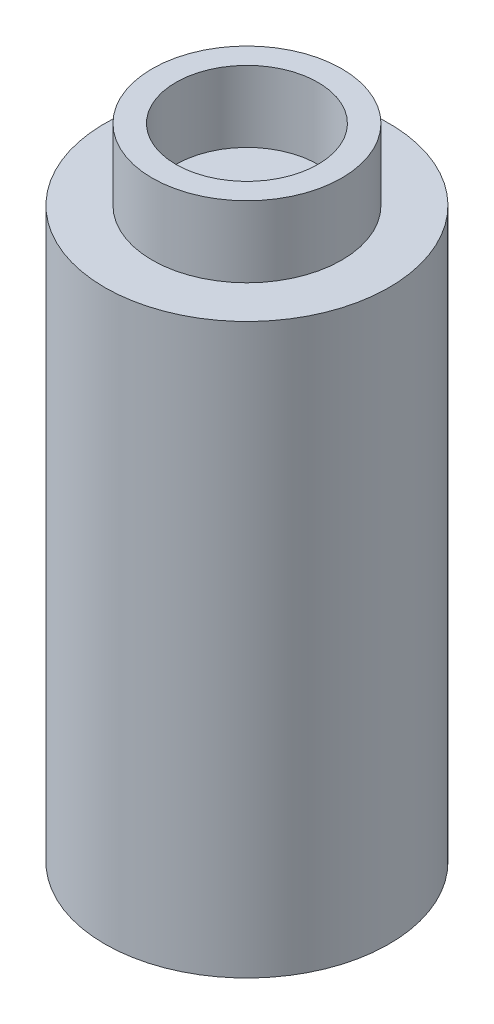
ISO-10303-21;
HEADER;
FILE_DESCRIPTION(('STEP AP214'),'2;1');
FILE_NAME('part.step','',(''),(''),'','','');
FILE_SCHEMA(('AUTOMOTIVE_DESIGN { 1 0 10303 214 1 1 1 1 }'));
ENDSEC;
DATA;
#1=APPLICATION_CONTEXT('core data for automotive mechanical design processes');
#2=APPLICATION_PROTOCOL_DEFINITION('international standard','automotive_design',2000,#1);
#3=PRODUCT_CONTEXT('',#1,'mechanical');
#4=PRODUCT('Part','Part','',(#3));
#5=PRODUCT_RELATED_PRODUCT_CATEGORY('part','',(#4));
#6=PRODUCT_DEFINITION_FORMATION('','',#4);
#7=PRODUCT_DEFINITION_CONTEXT('part definition',#1,'design');
#8=PRODUCT_DEFINITION('design','',#6,#7);
#9=PRODUCT_DEFINITION_SHAPE('','',#8);
#10=(LENGTH_UNIT() NAMED_UNIT(*) SI_UNIT(.MILLI.,.METRE.));
#11=(NAMED_UNIT(*) PLANE_ANGLE_UNIT() SI_UNIT($,.RADIAN.));
#12=(NAMED_UNIT(*) SI_UNIT($,.STERADIAN.) SOLID_ANGLE_UNIT());
#13=UNCERTAINTY_MEASURE_WITH_UNIT(LENGTH_MEASURE(1.E-05),#10,'distance_accuracy_value','');
#14=(GEOMETRIC_REPRESENTATION_CONTEXT(3) GLOBAL_UNCERTAINTY_ASSIGNED_CONTEXT((#13)) GLOBAL_UNIT_ASSIGNED_CONTEXT((#10,
#11,#12)) REPRESENTATION_CONTEXT('',''));
#15=CARTESIAN_POINT('',(0.,0.,0.));
#16=DIRECTION('',(0.,0.,1.));
#17=DIRECTION('',(1.,0.,0.));
#18=AXIS2_PLACEMENT_3D('',#15,#16,#17);
#19=CARTESIAN_POINT('',(0.,24.,0.));
#20=DIRECTION('',(0.,-1.,0.));
#21=DIRECTION('',(0.,0.,-1.));
#22=AXIS2_PLACEMENT_3D('',#19,#20,#21);
#23=CYLINDRICAL_SURFACE('',#22,6.);
#24=CARTESIAN_POINT('',(0.,24.,0.));
#25=DIRECTION('',(0.,1.,0.));
#26=DIRECTION('',(0.,0.,1.));
#27=AXIS2_PLACEMENT_3D('',#24,#25,#26);
#28=CIRCLE('',#27,6.);
#29=CARTESIAN_POINT('',(0.,24.,6.));
#30=VERTEX_POINT('',#29);
#31=EDGE_CURVE('E39',#30,#30,#28,.T.);
#32=ORIENTED_EDGE('',*,*,#31,.F.);
#33=EDGE_LOOP('',(#32));
#34=FACE_BOUND('',#33,.T.);
#35=CARTESIAN_POINT('',(0.,0.,0.));
#36=DIRECTION('',(0.,1.,0.));
#37=DIRECTION('',(0.,0.,1.));
#38=AXIS2_PLACEMENT_3D('',#35,#36,#37);
#39=CIRCLE('',#38,6.);
#40=CARTESIAN_POINT('',(0.,0.,6.));
#41=VERTEX_POINT('',#40);
#42=EDGE_CURVE('E35',#41,#41,#39,.T.);
#43=ORIENTED_EDGE('',*,*,#42,.T.);
#44=EDGE_LOOP('',(#43));
#45=FACE_BOUND('',#44,.T.);
#46=ADVANCED_FACE('F32',(#34,#45),#23,.T.);
#47=CARTESIAN_POINT('',(0.,24.,0.));
#48=DIRECTION('',(0.,1.,0.));
#49=DIRECTION('',(0.,0.,1.));
#50=AXIS2_PLACEMENT_3D('',#47,#48,#49);
#51=PLANE('',#50);
#52=CARTESIAN_POINT('',(0.,24.,0.));
#53=DIRECTION('',(0.,1.,0.));
#54=DIRECTION('',(0.,0.,1.));
#55=AXIS2_PLACEMENT_3D('',#52,#53,#54);
#56=CIRCLE('',#55,4.);
#57=CARTESIAN_POINT('',(0.,24.,4.));
#58=VERTEX_POINT('',#57);
#59=EDGE_CURVE('E10',#58,#58,#56,.T.);
#60=ORIENTED_EDGE('',*,*,#59,.F.);
#61=EDGE_LOOP('',(#60));
#62=FACE_BOUND('',#61,.T.);
#63=ORIENTED_EDGE('',*,*,#31,.T.);
#64=EDGE_LOOP('',(#63));
#65=FACE_BOUND('',#64,.T.);
#66=ADVANCED_FACE('F76',(#62,#65),#51,.T.);
#67=CARTESIAN_POINT('',(0.,0.,0.));
#68=DIRECTION('',(0.,1.,0.));
#69=DIRECTION('',(0.,0.,1.));
#70=AXIS2_PLACEMENT_3D('',#67,#68,#69);
#71=PLANE('',#70);
#72=ORIENTED_EDGE('',*,*,#42,.F.);
#73=EDGE_LOOP('',(#72));
#74=FACE_BOUND('',#73,.T.);
#75=ADVANCED_FACE('F71',(#74),#71,.F.);
#76=CARTESIAN_POINT('',(0.,27.,0.));
#77=DIRECTION('',(0.,-1.,0.));
#78=DIRECTION('',(0.,0.,-1.));
#79=AXIS2_PLACEMENT_3D('',#76,#77,#78);
#80=CYLINDRICAL_SURFACE('',#79,4.);
#81=CARTESIAN_POINT('',(0.,27.,0.));
#82=DIRECTION('',(0.,1.,0.));
#83=DIRECTION('',(0.,0.,1.));
#84=AXIS2_PLACEMENT_3D('',#81,#82,#83);
#85=CIRCLE('',#84,4.);
#86=CARTESIAN_POINT('',(0.,27.,4.));
#87=VERTEX_POINT('',#86);
#88=EDGE_CURVE('E45',#87,#87,#85,.T.);
#89=ORIENTED_EDGE('',*,*,#88,.F.);
#90=EDGE_LOOP('',(#89));
#91=FACE_BOUND('',#90,.T.);
#92=ORIENTED_EDGE('',*,*,#59,.T.);
#93=EDGE_LOOP('',(#92));
#94=FACE_BOUND('',#93,.T.);
#95=ADVANCED_FACE('F66',(#91,#94),#80,.T.);
#96=CARTESIAN_POINT('',(0.,27.,0.));
#97=DIRECTION('',(0.,1.,0.));
#98=DIRECTION('',(0.,0.,1.));
#99=AXIS2_PLACEMENT_3D('',#96,#97,#98);
#100=PLANE('',#99);
#101=CARTESIAN_POINT('',(0.,27.,0.));
#102=DIRECTION('',(0.,1.,0.));
#103=DIRECTION('',(0.,0.,1.));
#104=AXIS2_PLACEMENT_3D('',#101,#102,#103);
#105=CIRCLE('',#104,3.);
#106=CARTESIAN_POINT('',(0.,27.,3.));
#107=VERTEX_POINT('',#106);
#108=EDGE_CURVE('E49',#107,#107,#105,.T.);
#109=ORIENTED_EDGE('',*,*,#108,.F.);
#110=EDGE_LOOP('',(#109));
#111=FACE_BOUND('',#110,.T.);
#112=ORIENTED_EDGE('',*,*,#88,.T.);
#113=EDGE_LOOP('',(#112));
#114=FACE_BOUND('',#113,.T.);
#115=ADVANCED_FACE('F60',(#111,#114),#100,.T.);
#116=CARTESIAN_POINT('',(0.,24.,0.));
#117=DIRECTION('',(0.,1.,0.));
#118=DIRECTION('',(0.,0.,1.));
#119=AXIS2_PLACEMENT_3D('',#116,#117,#118);
#120=CYLINDRICAL_SURFACE('',#119,3.);
#121=CARTESIAN_POINT('',(0.,24.,0.));
#122=DIRECTION('',(0.,1.,0.));
#123=DIRECTION('',(0.,0.,1.));
#124=AXIS2_PLACEMENT_3D('',#121,#122,#123);
#125=CIRCLE('',#124,3.);
#126=CARTESIAN_POINT('',(0.,24.,3.));
#127=VERTEX_POINT('',#126);
#128=EDGE_CURVE('E48',#127,#127,#125,.T.);
#129=ORIENTED_EDGE('',*,*,#128,.F.);
#130=EDGE_LOOP('',(#129));
#131=FACE_BOUND('',#130,.T.);
#132=ORIENTED_EDGE('',*,*,#108,.T.);
#133=EDGE_LOOP('',(#132));
#134=FACE_BOUND('',#133,.T.);
#135=ADVANCED_FACE('F57',(#131,#134),#120,.F.);
#136=CARTESIAN_POINT('',(0.,24.,0.));
#137=DIRECTION('',(0.,1.,0.));
#138=DIRECTION('',(0.,0.,1.));
#139=AXIS2_PLACEMENT_3D('',#136,#137,#138);
#140=PLANE('',#139);
#141=ORIENTED_EDGE('',*,*,#128,.T.);
#142=EDGE_LOOP('',(#141));
#143=FACE_BOUND('',#142,.T.);
#144=ADVANCED_FACE('F55',(#143),#140,.T.);
#145=CLOSED_SHELL('',(#46,#66,#75,#95,#115,#135,#144));
#146=MANIFOLD_SOLID_BREP('B2',#145);
#147=ADVANCED_BREP_SHAPE_REPRESENTATION('',(#18,#146),#14);
#148=SHAPE_DEFINITION_REPRESENTATION(#9,#147);
ENDSEC;
END-ISO-10303-21;
